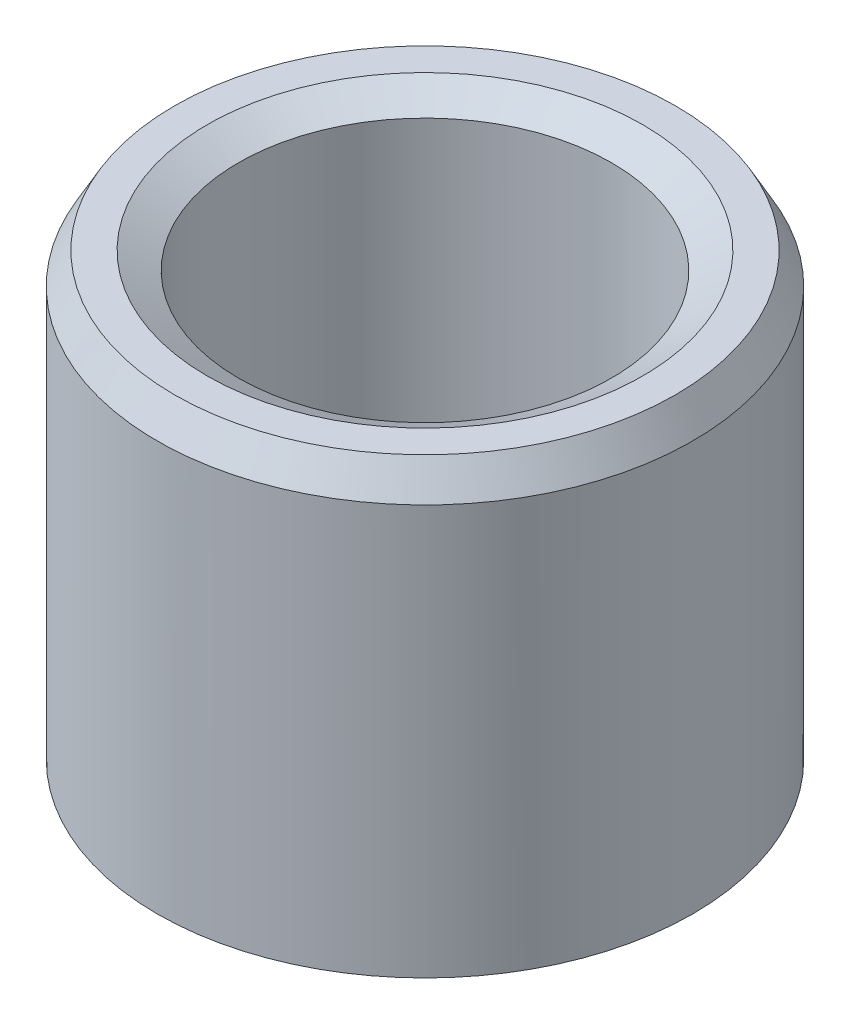
ISO-10303-21;
HEADER;
FILE_DESCRIPTION(('STEP AP214'),'2;1');
FILE_NAME('part.step','',(''),(''),'','','');
FILE_SCHEMA(('AUTOMOTIVE_DESIGN { 1 0 10303 214 1 1 1 1 }'));
ENDSEC;
DATA;
#1=APPLICATION_CONTEXT('core data for automotive mechanical design processes');
#2=APPLICATION_PROTOCOL_DEFINITION('international standard','automotive_design',2000,#1);
#3=PRODUCT_CONTEXT('',#1,'mechanical');
#4=PRODUCT('Part','Part','',(#3));
#5=PRODUCT_RELATED_PRODUCT_CATEGORY('part','',(#4));
#6=PRODUCT_DEFINITION_FORMATION('','',#4);
#7=PRODUCT_DEFINITION_CONTEXT('part definition',#1,'design');
#8=PRODUCT_DEFINITION('design','',#6,#7);
#9=PRODUCT_DEFINITION_SHAPE('','',#8);
#10=(LENGTH_UNIT() NAMED_UNIT(*) SI_UNIT(.MILLI.,.METRE.));
#11=(NAMED_UNIT(*) PLANE_ANGLE_UNIT() SI_UNIT($,.RADIAN.));
#12=(NAMED_UNIT(*) SI_UNIT($,.STERADIAN.) SOLID_ANGLE_UNIT());
#13=UNCERTAINTY_MEASURE_WITH_UNIT(LENGTH_MEASURE(1.E-05),#10,'distance_accuracy_value','');
#14=(GEOMETRIC_REPRESENTATION_CONTEXT(3) GLOBAL_UNCERTAINTY_ASSIGNED_CONTEXT((#13)) GLOBAL_UNIT_ASSIGNED_CONTEXT((#10,
#11,#12)) REPRESENTATION_CONTEXT('',''));
#15=CARTESIAN_POINT('',(0.,0.,0.));
#16=DIRECTION('',(0.,0.,1.));
#17=DIRECTION('',(1.,0.,0.));
#18=AXIS2_PLACEMENT_3D('',#15,#16,#17);
#19=CARTESIAN_POINT('',(0.,47.051473049987,0.));
#20=DIRECTION('',(0.,-1.,0.));
#21=DIRECTION('',(0.,0.,-1.));
#22=AXIS2_PLACEMENT_3D('',#19,#20,#21);
#23=CYLINDRICAL_SURFACE('',#22,27.5);
#24=CARTESIAN_POINT('',(0.,1.78604066498773,0.));
#25=DIRECTION('',(0.,1.,0.));
#26=DIRECTION('',(0.,0.,1.));
#27=AXIS2_PLACEMENT_3D('',#24,#25,#26);
#28=CIRCLE('',#27,27.5);
#29=CARTESIAN_POINT('',(0.,1.78604066498773,-27.5));
#30=VERTEX_POINT('',#29);
#31=EDGE_CURVE('E10',#30,#30,#28,.T.);
#32=CARTESIAN_POINT('',(0.,43.8496819512204,0.));
#33=DIRECTION('',(0.,1.,0.));
#34=DIRECTION('',(0.,0.,1.));
#35=AXIS2_PLACEMENT_3D('',#32,#33,#34);
#36=CIRCLE('',#35,27.5);
#37=CARTESIAN_POINT('',(0.,43.8496819512204,-27.5));
#38=VERTEX_POINT('',#37);
#39=EDGE_CURVE('E50',#38,#38,#36,.F.);
#40=CARTESIAN_POINT('',(0.,1.78604066498773,-27.5));
#41=CARTESIAN_POINT('',(0.,2.22420359505265,-27.5));
#42=CARTESIAN_POINT('',(0.,2.66236652511758,-27.5));
#43=CARTESIAN_POINT('',(0.,3.53869238524743,-27.5));
#44=CARTESIAN_POINT('',(0.,3.97685531531235,-27.5));
#45=CARTESIAN_POINT('',(0.,4.8531811754422,-27.5));
#46=CARTESIAN_POINT('',(0.,5.29134410550712,-27.5));
#47=CARTESIAN_POINT('',(0.,6.16766996563697,-27.5));
#48=CARTESIAN_POINT('',(0.,6.60583289570189,-27.5));
#49=CARTESIAN_POINT('',(0.,7.48215875583174,-27.5));
#50=CARTESIAN_POINT('',(0.,7.92032168589666,-27.5));
#51=CARTESIAN_POINT('',(0.,8.79664754602651,-27.5));
#52=CARTESIAN_POINT('',(0.,9.23481047609143,-27.5));
#53=CARTESIAN_POINT('',(0.,10.1111363362213,-27.5));
#54=CARTESIAN_POINT('',(0.,10.5492992662862,-27.5));
#55=CARTESIAN_POINT('',(0.,11.4256251264161,-27.5));
#56=CARTESIAN_POINT('',(0.,11.863788056481,-27.5));
#57=CARTESIAN_POINT('',(0.,12.7401139166108,-27.5));
#58=CARTESIAN_POINT('',(0.,13.1782768466757,-27.5));
#59=CARTESIAN_POINT('',(0.,14.0546027068056,-27.5));
#60=CARTESIAN_POINT('',(0.,14.4927656368705,-27.5));
#61=CARTESIAN_POINT('',(0.,15.3690914970004,-27.5));
#62=CARTESIAN_POINT('',(0.,15.8072544270653,-27.5));
#63=CARTESIAN_POINT('',(0.,16.6835802871951,-27.5));
#64=CARTESIAN_POINT('',(0.,17.1217432172601,-27.5));
#65=CARTESIAN_POINT('',(0.,17.9980690773899,-27.5));
#66=CARTESIAN_POINT('',(0.,18.4362320074548,-27.5));
#67=CARTESIAN_POINT('',(0.,19.3125578675847,-27.5));
#68=CARTESIAN_POINT('',(0.,19.7507207976496,-27.5));
#69=CARTESIAN_POINT('',(0.,20.6270466577795,-27.5));
#70=CARTESIAN_POINT('',(0.,21.0652095878444,-27.5));
#71=CARTESIAN_POINT('',(0.,21.9415354479742,-27.5));
#72=CARTESIAN_POINT('',(0.,22.3796983780392,-27.5));
#73=CARTESIAN_POINT('',(0.,23.256024238169,-27.5));
#74=CARTESIAN_POINT('',(0.,23.6941871682339,-27.5));
#75=CARTESIAN_POINT('',(0.,24.5705130283638,-27.5));
#76=CARTESIAN_POINT('',(0.,25.0086759584287,-27.5));
#77=CARTESIAN_POINT('',(0.,25.8850018185585,-27.5));
#78=CARTESIAN_POINT('',(0.,26.3231647486235,-27.5));
#79=CARTESIAN_POINT('',(0.,27.1994906087533,-27.5));
#80=CARTESIAN_POINT('',(0.,27.6376535388182,-27.5));
#81=CARTESIAN_POINT('',(0.,28.5139793989481,-27.5));
#82=CARTESIAN_POINT('',(0.,28.952142329013,-27.5));
#83=CARTESIAN_POINT('',(0.,29.8284681891429,-27.5));
#84=CARTESIAN_POINT('',(0.,30.2666311192078,-27.5));
#85=CARTESIAN_POINT('',(0.,31.1429569793376,-27.5));
#86=CARTESIAN_POINT('',(0.,31.5811199094026,-27.5));
#87=CARTESIAN_POINT('',(0.,32.4574457695324,-27.5));
#88=CARTESIAN_POINT('',(0.,32.8956086995973,-27.5));
#89=CARTESIAN_POINT('',(0.,33.7719345597272,-27.5));
#90=CARTESIAN_POINT('',(0.,34.2100974897921,-27.5));
#91=CARTESIAN_POINT('',(0.,35.0864233499219,-27.5));
#92=CARTESIAN_POINT('',(0.,35.5245862799869,-27.5));
#93=CARTESIAN_POINT('',(0.,36.4009121401167,-27.5));
#94=CARTESIAN_POINT('',(0.,36.8390750701816,-27.5));
#95=CARTESIAN_POINT('',(0.,37.7154009303115,-27.5));
#96=CARTESIAN_POINT('',(0.,38.1535638603764,-27.5));
#97=CARTESIAN_POINT('',(0.,39.0298897205063,-27.5));
#98=CARTESIAN_POINT('',(0.,39.4680526505712,-27.5));
#99=CARTESIAN_POINT('',(0.,40.344378510701,-27.5));
#100=CARTESIAN_POINT('',(0.,40.782541440766,-27.5));
#101=CARTESIAN_POINT('',(0.,41.6588673008958,-27.5));
#102=CARTESIAN_POINT('',(0.,42.0970302309607,-27.5));
#103=CARTESIAN_POINT('',(0.,42.9733560910906,-27.5));
#104=CARTESIAN_POINT('',(0.,43.4115190211555,-27.5));
#105=CARTESIAN_POINT('',(0.,43.8496819512204,-27.5));
#106=B_SPLINE_CURVE_WITH_KNOTS('',3,(#40,#41,#42,#43,#44,#45,#46,#47,#48,#49,#50,#51,#52,#53,
#54,#55,#56,#57,#58,#59,#60,#61,#62,#63,#64,#65,#66,#67,#68,#69,#70,#71,#72,#73,#74,#75,#76,#77,
#78,#79,#80,#81,#82,#83,#84,#85,#86,#87,#88,#89,#90,#91,#92,#93,#94,#95,#96,#97,#98,#99,#100,
#101,#102,#103,#104,#105),.UNSPECIFIED.,.F.,.F.,(4,2,2,2,2,2,2,2,2,2,2,2,2,2,2,2,2,2,2,2,2,2,2,
2,2,2,2,2,2,2,2,2,4),(0.,1.31448879019477,2.62897758038955,3.94346637058432,5.25795516077909,
6.57244395097386,7.88693274116863,9.20142153136341,10.5159103215582,11.8303991117529,
13.1448879019477,14.4593766921425,15.7738654823373,17.088354272532,18.4028430627268,
19.7173318529216,21.0318206431163,22.3463094333111,23.6607982235059,24.9752870137007,
26.2897758038954,27.6042645940902,28.918753384285,30.2332421744798,31.5477309646745,
32.8622197548693,34.1767085450641,35.4911973352588,36.8056861254536,38.1201749156484,
39.4346637058431,40.7491524960379,42.0636412862327),.UNSPECIFIED.);
#107=EDGE_CURVE('BSEAM39',#30,#38,#106,.T.);
#108=ORIENTED_EDGE('',*,*,#31,.T.);
#109=ORIENTED_EDGE('',*,*,#39,.T.);
#110=ORIENTED_EDGE('',*,*,#107,.T.);
#111=ORIENTED_EDGE('',*,*,#107,.F.);
#112=EDGE_LOOP('',(#108,#110,#109,#111));
#113=FACE_BOUND('',#112,.T.);
#114=ADVANCED_FACE('F39',(#113),#23,.T.);
#115=CARTESIAN_POINT('',(0.,47.051473049987,0.));
#116=DIRECTION('',(0.,1.,0.));
#117=DIRECTION('',(0.,0.,1.));
#118=AXIS2_PLACEMENT_3D('',#115,#116,#117);
#119=PLANE('',#118);
#120=CARTESIAN_POINT('',(0.,47.051473049987,0.));
#121=DIRECTION('',(0.,1.,0.));
#122=DIRECTION('',(0.,0.,1.));
#123=AXIS2_PLACEMENT_3D('',#120,#121,#122);
#124=CIRCLE('',#123,22.3580910140399);
#125=CARTESIAN_POINT('',(0.,47.051473049987,22.3580910140399));
#126=VERTEX_POINT('',#125);
#127=EDGE_CURVE('E58',#126,#126,#124,.F.);
#128=ORIENTED_EDGE('',*,*,#127,.T.);
#129=EDGE_LOOP('',(#128));
#130=FACE_BOUND('',#129,.T.);
#131=CARTESIAN_POINT('',(0.,47.051473049987,0.));
#132=DIRECTION('',(0.,1.,0.));
#133=DIRECTION('',(0.,0.,1.));
#134=AXIS2_PLACEMENT_3D('',#131,#132,#133);
#135=CIRCLE('',#134,25.7139593350124);
#136=CARTESIAN_POINT('',(0.,47.051473049987,25.7139593350124));
#137=VERTEX_POINT('',#136);
#138=EDGE_CURVE('E61',#137,#137,#135,.T.);
#139=ORIENTED_EDGE('',*,*,#138,.T.);
#140=EDGE_LOOP('',(#139));
#141=FACE_BOUND('',#140,.T.);
#142=ADVANCED_FACE('F88',(#130,#141),#119,.T.);
#143=CARTESIAN_POINT('',(0.,0.,0.));
#144=DIRECTION('',(0.,1.,0.));
#145=DIRECTION('',(0.,0.,1.));
#146=AXIS2_PLACEMENT_3D('',#143,#144,#145);
#147=PLANE('',#146);
#148=CARTESIAN_POINT('',(0.,0.,0.));
#149=DIRECTION('',(0.,1.,0.));
#150=DIRECTION('',(0.,0.,1.));
#151=AXIS2_PLACEMENT_3D('',#148,#149,#150);
#152=CIRCLE('',#151,20.9423405802608);
#153=CARTESIAN_POINT('',(0.,0.,20.9423405802608));
#154=VERTEX_POINT('',#153);
#155=EDGE_CURVE('E51',#154,#154,#152,.T.);
#156=ORIENTED_EDGE('',*,*,#155,.T.);
#157=EDGE_LOOP('',(#156));
#158=FACE_BOUND('',#157,.T.);
#159=CARTESIAN_POINT('',(0.,0.,0.));
#160=DIRECTION('',(0.,1.,0.));
#161=DIRECTION('',(0.,0.,1.));
#162=AXIS2_PLACEMENT_3D('',#159,#160,#161);
#163=CIRCLE('',#162,24.2982089012333);
#164=CARTESIAN_POINT('',(0.,0.,24.2982089012333));
#165=VERTEX_POINT('',#164);
#166=EDGE_CURVE('E54',#165,#165,#163,.F.);
#167=ORIENTED_EDGE('',*,*,#166,.T.);
#168=EDGE_LOOP('',(#167));
#169=FACE_BOUND('',#168,.T.);
#170=ADVANCED_FACE('F83',(#158,#169),#147,.F.);
#171=CARTESIAN_POINT('',(0.,47.051473049987,0.));
#172=DIRECTION('',(0.,-1.,0.));
#173=DIRECTION('',(0.,0.,-1.));
#174=AXIS2_PLACEMENT_3D('',#171,#172,#173);
#175=CYLINDRICAL_SURFACE('',#174,19.1562999152732);
#176=CARTESIAN_POINT('',(0.,45.2654323849993,0.));
#177=DIRECTION('',(0.,1.,0.));
#178=DIRECTION('',(0.,0.,1.));
#179=AXIS2_PLACEMENT_3D('',#176,#177,#178);
#180=CIRCLE('',#179,19.1562999152732);
#181=CARTESIAN_POINT('',(0.,45.2654323849993,-19.1562999152732));
#182=VERTEX_POINT('',#181);
#183=EDGE_CURVE('E67',#182,#182,#180,.T.);
#184=CARTESIAN_POINT('',(0.,3.20179109876665,0.));
#185=DIRECTION('',(0.,1.,0.));
#186=DIRECTION('',(0.,0.,1.));
#187=AXIS2_PLACEMENT_3D('',#184,#185,#186);
#188=CIRCLE('',#187,19.1562999152732);
#189=CARTESIAN_POINT('',(0.,3.20179109876665,-19.1562999152732));
#190=VERTEX_POINT('',#189);
#191=EDGE_CURVE('E69',#190,#190,#188,.F.);
#192=CARTESIAN_POINT('',(0.,45.2654323849993,-19.1562999152732));
#193=CARTESIAN_POINT('',(0.,44.8272694549344,-19.1562999152732));
#194=CARTESIAN_POINT('',(0.,44.3891065248694,-19.1562999152732));
#195=CARTESIAN_POINT('',(0.,43.5127806647396,-19.1562999152732));
#196=CARTESIAN_POINT('',(0.,43.0746177346747,-19.1562999152732));
#197=CARTESIAN_POINT('',(0.,42.1982918745448,-19.1562999152732));
#198=CARTESIAN_POINT('',(0.,41.7601289444799,-19.1562999152732));
#199=CARTESIAN_POINT('',(0.,40.88380308435,-19.1562999152732));
#200=CARTESIAN_POINT('',(0.,40.4456401542851,-19.1562999152732));
#201=CARTESIAN_POINT('',(0.,39.5693142941553,-19.1562999152732));
#202=CARTESIAN_POINT('',(0.,39.1311513640904,-19.1562999152732));
#203=CARTESIAN_POINT('',(0.,38.2548255039605,-19.1562999152732));
#204=CARTESIAN_POINT('',(0.,37.8166625738956,-19.1562999152732));
#205=CARTESIAN_POINT('',(0.,36.9403367137657,-19.1562999152732));
#206=CARTESIAN_POINT('',(0.,36.5021737837008,-19.1562999152732));
#207=CARTESIAN_POINT('',(0.,35.625847923571,-19.1562999152732));
#208=CARTESIAN_POINT('',(0.,35.1876849935061,-19.1562999152732));
#209=CARTESIAN_POINT('',(0.,34.3113591333762,-19.1562999152732));
#210=CARTESIAN_POINT('',(0.,33.8731962033113,-19.1562999152732));
#211=CARTESIAN_POINT('',(0.,32.9968703431814,-19.1562999152732));
#212=CARTESIAN_POINT('',(0.,32.5587074131165,-19.1562999152732));
#213=CARTESIAN_POINT('',(0.,31.6823815529867,-19.1562999152732));
#214=CARTESIAN_POINT('',(0.,31.2442186229217,-19.1562999152732));
#215=CARTESIAN_POINT('',(0.,30.3678927627919,-19.1562999152732));
#216=CARTESIAN_POINT('',(0.,29.929729832727,-19.1562999152732));
#217=CARTESIAN_POINT('',(0.,29.0534039725971,-19.1562999152732));
#218=CARTESIAN_POINT('',(0.,28.6152410425322,-19.1562999152732));
#219=CARTESIAN_POINT('',(0.,27.7389151824024,-19.1562999152732));
#220=CARTESIAN_POINT('',(0.,27.3007522523374,-19.1562999152732));
#221=CARTESIAN_POINT('',(0.,26.4244263922076,-19.1562999152732));
#222=CARTESIAN_POINT('',(0.,25.9862634621427,-19.1562999152732));
#223=CARTESIAN_POINT('',(0.,25.1099376020128,-19.1562999152732));
#224=CARTESIAN_POINT('',(0.,24.6717746719479,-19.1562999152732));
#225=CARTESIAN_POINT('',(0.,23.795448811818,-19.1562999152732));
#226=CARTESIAN_POINT('',(0.,23.3572858817531,-19.1562999152732));
#227=CARTESIAN_POINT('',(0.,22.4809600216233,-19.1562999152732));
#228=CARTESIAN_POINT('',(0.,22.0427970915584,-19.1562999152732));
#229=CARTESIAN_POINT('',(0.,21.1664712314285,-19.1562999152732));
#230=CARTESIAN_POINT('',(0.,20.7283083013636,-19.1562999152732));
#231=CARTESIAN_POINT('',(0.,19.8519824412337,-19.1562999152732));
#232=CARTESIAN_POINT('',(0.,19.4138195111688,-19.1562999152732));
#233=CARTESIAN_POINT('',(0.,18.537493651039,-19.1562999152732));
#234=CARTESIAN_POINT('',(0.,18.099330720974,-19.1562999152732));
#235=CARTESIAN_POINT('',(0.,17.2230048608442,-19.1562999152732));
#236=CARTESIAN_POINT('',(0.,16.7848419307793,-19.1562999152732));
#237=CARTESIAN_POINT('',(0.,15.9085160706494,-19.1562999152732));
#238=CARTESIAN_POINT('',(0.,15.4703531405845,-19.1562999152732));
#239=CARTESIAN_POINT('',(0.,14.5940272804547,-19.1562999152732));
#240=CARTESIAN_POINT('',(0.,14.1558643503897,-19.1562999152732));
#241=CARTESIAN_POINT('',(0.,13.2795384902599,-19.1562999152732));
#242=CARTESIAN_POINT('',(0.,12.841375560195,-19.1562999152732));
#243=CARTESIAN_POINT('',(0.,11.9650497000651,-19.1562999152732));
#244=CARTESIAN_POINT('',(0.,11.5268867700002,-19.1562999152732));
#245=CARTESIAN_POINT('',(0.,10.6505609098703,-19.1562999152732));
#246=CARTESIAN_POINT('',(0.,10.2123979798054,-19.1562999152732));
#247=CARTESIAN_POINT('',(0.,9.33607211967558,-19.1562999152732));
#248=CARTESIAN_POINT('',(0.,8.89790918961065,-19.1562999152732));
#249=CARTESIAN_POINT('',(0.,8.02158332948081,-19.1562999152732));
#250=CARTESIAN_POINT('',(0.,7.58342039941589,-19.1562999152732));
#251=CARTESIAN_POINT('',(0.,6.70709453928604,-19.1562999152732));
#252=CARTESIAN_POINT('',(0.,6.26893160922111,-19.1562999152732));
#253=CARTESIAN_POINT('',(0.,5.39260574909127,-19.1562999152732));
#254=CARTESIAN_POINT('',(0.,4.95444281902635,-19.1562999152732));
#255=CARTESIAN_POINT('',(0.,4.0781169588965,-19.1562999152732));
#256=CARTESIAN_POINT('',(0.,3.63995402883157,-19.1562999152732));
#257=CARTESIAN_POINT('',(0.,3.20179109876665,-19.1562999152732));
#258=B_SPLINE_CURVE_WITH_KNOTS('',3,(#192,#193,#194,#195,#196,#197,#198,#199,#200,#201,#202,
#203,#204,#205,#206,#207,#208,#209,#210,#211,#212,#213,#214,#215,#216,#217,#218,#219,#220,#221,
#222,#223,#224,#225,#226,#227,#228,#229,#230,#231,#232,#233,#234,#235,#236,#237,#238,#239,#240,
#241,#242,#243,#244,#245,#246,#247,#248,#249,#250,#251,#252,#253,#254,#255,#256,#257),
.UNSPECIFIED.,.F.,.F.,(4,2,2,2,2,2,2,2,2,2,2,2,2,2,2,2,2,2,2,2,2,2,2,2,2,2,2,2,2,2,2,2,4),(0.,
1.31448879019477,2.62897758038954,3.94346637058431,5.25795516077908,6.57244395097385,
7.88693274116862,9.20142153136339,10.5159103215582,11.8303991117529,13.1448879019477,
14.4593766921425,15.7738654823372,17.088354272532,18.4028430627268,19.7173318529215,
21.0318206431163,22.3463094333111,23.6607982235059,24.9752870137006,26.2897758038954,
27.6042645940902,28.9187533842849,30.2332421744797,31.5477309646745,32.8622197548692,
34.176708545064,35.4911973352588,36.8056861254536,38.1201749156483,39.4346637058431,
40.7491524960379,42.0636412862326),.UNSPECIFIED.);
#259=EDGE_CURVE('BSEAM71',#182,#190,#258,.T.);
#260=ORIENTED_EDGE('',*,*,#183,.T.);
#261=ORIENTED_EDGE('',*,*,#191,.T.);
#262=ORIENTED_EDGE('',*,*,#259,.T.);
#263=ORIENTED_EDGE('',*,*,#259,.F.);
#264=EDGE_LOOP('',(#260,#262,#261,#263));
#265=FACE_BOUND('',#264,.T.);
#266=ADVANCED_FACE('F71',(#265),#175,.F.);
#267=CARTESIAN_POINT('',(0.,45.2654323849993,0.));
#268=DIRECTION('',(0.,1.,0.));
#269=DIRECTION('',(0.,0.,1.));
#270=AXIS2_PLACEMENT_3D('',#267,#268,#269);
#271=CONICAL_SURFACE('',#270,19.1562999152732,1.06196492711602);
#272=ORIENTED_EDGE('',*,*,#127,.F.);
#273=EDGE_LOOP('',(#272));
#274=FACE_BOUND('',#273,.T.);
#275=ORIENTED_EDGE('',*,*,#183,.F.);
#276=EDGE_LOOP('',(#275));
#277=FACE_BOUND('',#276,.T.);
#278=ADVANCED_FACE('F77',(#274,#277),#271,.F.);
#279=CARTESIAN_POINT('',(0.,0.,0.));
#280=DIRECTION('',(0.,-1.,0.));
#281=DIRECTION('',(0.,0.,-1.));
#282=AXIS2_PLACEMENT_3D('',#279,#280,#281);
#283=CONICAL_SURFACE('',#282,20.9423405802608,0.508831399678877);
#284=ORIENTED_EDGE('',*,*,#191,.F.);
#285=EDGE_LOOP('',(#284));
#286=FACE_BOUND('',#285,.T.);
#287=ORIENTED_EDGE('',*,*,#155,.F.);
#288=EDGE_LOOP('',(#287));
#289=FACE_BOUND('',#288,.T.);
#290=ADVANCED_FACE('F73',(#286,#289),#283,.F.);
#291=CARTESIAN_POINT('',(0.,1.78604066498773,0.));
#292=DIRECTION('',(0.,1.,0.));
#293=DIRECTION('',(0.,0.,1.));
#294=AXIS2_PLACEMENT_3D('',#291,#292,#293);
#295=CONICAL_SURFACE('',#294,27.5,1.06196492711602);
#296=ORIENTED_EDGE('',*,*,#166,.F.);
#297=EDGE_LOOP('',(#296));
#298=FACE_BOUND('',#297,.T.);
#299=ORIENTED_EDGE('',*,*,#31,.F.);
#300=EDGE_LOOP('',(#299));
#301=FACE_BOUND('',#300,.T.);
#302=ADVANCED_FACE('F76',(#298,#301),#295,.T.);
#303=CARTESIAN_POINT('',(0.,47.051473049987,0.));
#304=DIRECTION('',(0.,-1.,0.));
#305=DIRECTION('',(0.,0.,-1.));
#306=AXIS2_PLACEMENT_3D('',#303,#304,#305);
#307=CONICAL_SURFACE('',#306,25.7139593350124,0.508831399678878);
#308=ORIENTED_EDGE('',*,*,#39,.F.);
#309=EDGE_LOOP('',(#308));
#310=FACE_BOUND('',#309,.T.);
#311=ORIENTED_EDGE('',*,*,#138,.F.);
#312=EDGE_LOOP('',(#311));
#313=FACE_BOUND('',#312,.T.);
#314=ADVANCED_FACE('F45',(#310,#313),#307,.T.);
#315=CLOSED_SHELL('',(#114,#142,#170,#266,#278,#290,#302,#314));
#316=MANIFOLD_SOLID_BREP('B2',#315);
#317=ADVANCED_BREP_SHAPE_REPRESENTATION('',(#18,#316),#14);
#318=SHAPE_DEFINITION_REPRESENTATION(#9,#317);
ENDSEC;
END-ISO-10303-21;
